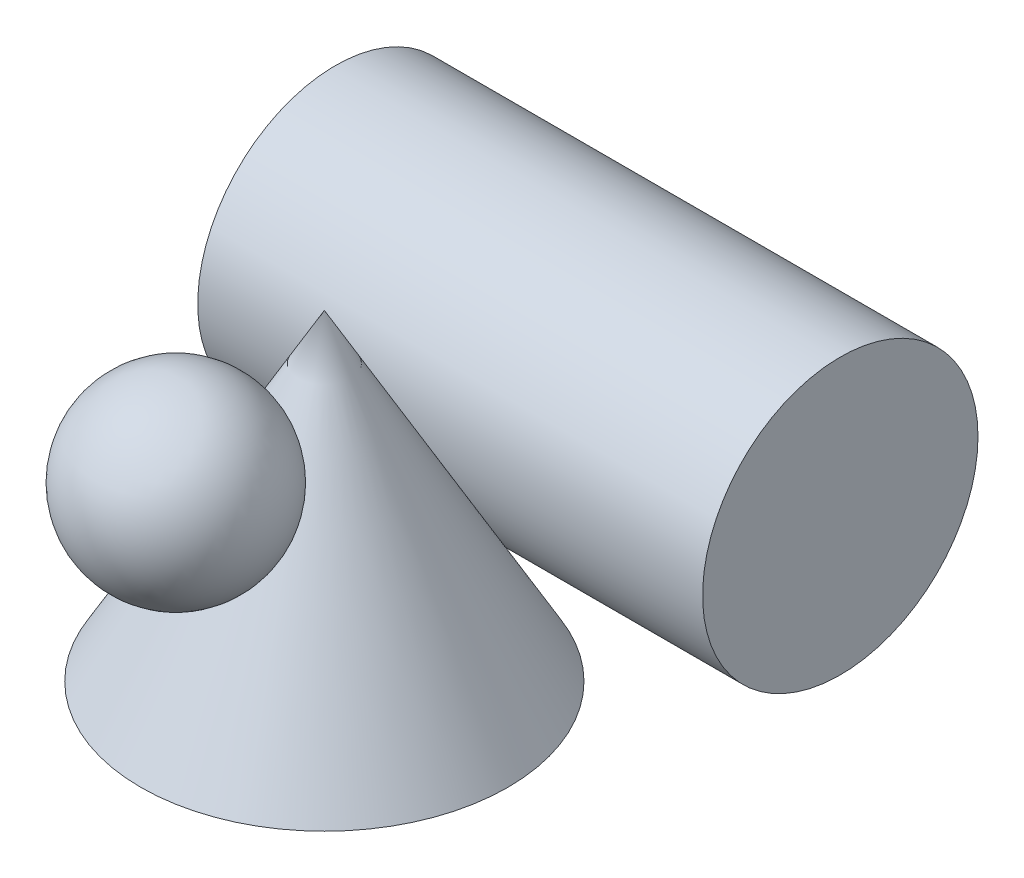
ISO-10303-21;
HEADER;
FILE_DESCRIPTION(('STEP AP214'),'2;1');
FILE_NAME('part.step','',(''),(''),'','','');
FILE_SCHEMA(('AUTOMOTIVE_DESIGN { 1 0 10303 214 1 1 1 1 }'));
ENDSEC;
DATA;
#1=APPLICATION_CONTEXT('core data for automotive mechanical design processes');
#2=APPLICATION_PROTOCOL_DEFINITION('international standard','automotive_design',2000,#1);
#3=PRODUCT_CONTEXT('',#1,'mechanical');
#4=PRODUCT('Part','Part','',(#3));
#5=PRODUCT_RELATED_PRODUCT_CATEGORY('part','',(#4));
#6=PRODUCT_DEFINITION_FORMATION('','',#4);
#7=PRODUCT_DEFINITION_CONTEXT('part definition',#1,'design');
#8=PRODUCT_DEFINITION('design','',#6,#7);
#9=PRODUCT_DEFINITION_SHAPE('','',#8);
#10=(LENGTH_UNIT() NAMED_UNIT(*) SI_UNIT(.MILLI.,.METRE.));
#11=(NAMED_UNIT(*) PLANE_ANGLE_UNIT() SI_UNIT($,.RADIAN.));
#12=(NAMED_UNIT(*) SI_UNIT($,.STERADIAN.) SOLID_ANGLE_UNIT());
#13=UNCERTAINTY_MEASURE_WITH_UNIT(LENGTH_MEASURE(1.E-05),#10,'distance_accuracy_value','');
#14=(GEOMETRIC_REPRESENTATION_CONTEXT(3) GLOBAL_UNCERTAINTY_ASSIGNED_CONTEXT((#13)) GLOBAL_UNIT_ASSIGNED_CONTEXT((#10,
#11,#12)) REPRESENTATION_CONTEXT('',''));
#15=CARTESIAN_POINT('',(0.,0.,0.));
#16=DIRECTION('',(0.,0.,1.));
#17=DIRECTION('',(1.,0.,0.));
#18=AXIS2_PLACEMENT_3D('',#15,#16,#17);
#19=CARTESIAN_POINT('',(0.,53.6727787671367,32.3648628424892));
#20=DIRECTION('',(0.,1.,0.));
#21=DIRECTION('',(0.,0.,-1.));
#22=AXIS2_PLACEMENT_3D('',#19,#20,#21);
#23=SPHERICAL_SURFACE('',#22,20.);
#24=CARTESIAN_POINT('',(0.,73.6727787671367,32.3648628424892));
#25=VERTEX_POINT('',#24);
#26=VERTEX_LOOP('',#25);
#27=FACE_BOUND('',#26,.T.);
#28=ADVANCED_FACE('F36',(#27),#23,.T.);
#29=CLOSED_SHELL('',(#28));
#30=MANIFOLD_SOLID_BREP('B2',#29);
#31=CARTESIAN_POINT('',(-55.,30.,-57.4096760641366));
#32=DIRECTION('',(1.,0.,0.));
#33=DIRECTION('',(0.,0.,-1.));
#34=AXIS2_PLACEMENT_3D('',#31,#32,#33);
#35=CYLINDRICAL_SURFACE('',#34,30.);
#36=CARTESIAN_POINT('',(-55.,30.,-57.4096760641366));
#37=DIRECTION('',(1.,0.,0.));
#38=DIRECTION('',(0.,0.,-1.));
#39=AXIS2_PLACEMENT_3D('',#36,#37,#38);
#40=CIRCLE('',#39,30.);
#41=CARTESIAN_POINT('',(-55.,30.,-87.4096760641366));
#42=VERTEX_POINT('',#41);
#43=EDGE_CURVE('E35',#42,#42,#40,.T.);
#44=ORIENTED_EDGE('',*,*,#43,.T.);
#45=EDGE_LOOP('',(#44));
#46=FACE_BOUND('',#45,.T.);
#47=CARTESIAN_POINT('',(55.,30.,-57.4096760641366));
#48=DIRECTION('',(1.,0.,0.));
#49=DIRECTION('',(0.,0.,-1.));
#50=AXIS2_PLACEMENT_3D('',#47,#48,#49);
#51=CIRCLE('',#50,30.);
#52=CARTESIAN_POINT('',(55.,30.,-87.4096760641366));
#53=VERTEX_POINT('',#52);
#54=EDGE_CURVE('E61',#53,#53,#51,.T.);
#55=ORIENTED_EDGE('',*,*,#54,.F.);
#56=EDGE_LOOP('',(#55));
#57=FACE_BOUND('',#56,.T.);
#58=ADVANCED_FACE('F58',(#46,#57),#35,.T.);
#59=CARTESIAN_POINT('',(-55.,30.,-57.4096760641366));
#60=DIRECTION('',(1.,0.,0.));
#61=DIRECTION('',(0.,0.,-1.));
#62=AXIS2_PLACEMENT_3D('',#59,#60,#61);
#63=PLANE('',#62);
#64=ORIENTED_EDGE('',*,*,#43,.F.);
#65=EDGE_LOOP('',(#64));
#66=FACE_BOUND('',#65,.T.);
#67=ADVANCED_FACE('F73',(#66),#63,.F.);
#68=CARTESIAN_POINT('',(55.,30.,-57.4096760641366));
#69=DIRECTION('',(1.,0.,0.));
#70=DIRECTION('',(0.,0.,-1.));
#71=AXIS2_PLACEMENT_3D('',#68,#69,#70);
#72=PLANE('',#71);
#73=ORIENTED_EDGE('',*,*,#54,.T.);
#74=EDGE_LOOP('',(#73));
#75=FACE_BOUND('',#74,.T.);
#76=ADVANCED_FACE('F70',(#75),#72,.T.);
#77=CLOSED_SHELL('',(#58,#67,#76));
#78=MANIFOLD_SOLID_BREP('B6',#77);
#79=CARTESIAN_POINT('',(0.,0.,0.));
#80=DIRECTION('',(0.,1.,0.));
#81=DIRECTION('',(-1.,0.,0.));
#82=AXIS2_PLACEMENT_3D('',#79,#80,#81);
#83=PLANE('',#82);
#84=CARTESIAN_POINT('',(0.,0.,0.));
#85=DIRECTION('',(0.,1.,0.));
#86=DIRECTION('',(-1.,0.,0.));
#87=AXIS2_PLACEMENT_3D('',#84,#85,#86);
#88=CIRCLE('',#87,40.);
#89=CARTESIAN_POINT('',(-40.,0.,0.));
#90=VERTEX_POINT('',#89);
#91=EDGE_CURVE('E56',#90,#90,#88,.T.);
#92=ORIENTED_EDGE('',*,*,#91,.F.);
#93=EDGE_LOOP('',(#92));
#94=FACE_BOUND('',#93,.T.);
#95=ADVANCED_FACE('F99',(#94),#83,.F.);
#96=CARTESIAN_POINT('',(0.,0.,0.));
#97=DIRECTION('',(0.,-1.,0.));
#98=DIRECTION('',(1.,0.,0.));
#99=AXIS2_PLACEMENT_3D('',#96,#97,#98);
#100=CONICAL_SURFACE('',#99,40.,0.519146114246523);
#101=CARTESIAN_POINT('',(0.,43.75,15.));
#102=VERTEX_POINT('',#101);
#103=VERTEX_LOOP('',#102);
#104=FACE_BOUND('',#103,.T.);
#105=CARTESIAN_POINT('',(0.,15.115831849295,-31.3623818004029));
#106=VERTEX_POINT('',#105);
#107=VERTEX_LOOP('',#106);
#108=FACE_BOUND('',#107,.T.);
#109=CARTESIAN_POINT('',(0.,70.,0.));
#110=VERTEX_POINT('',#109);
#111=VERTEX_LOOP('',#110);
#112=FACE_BOUND('',#111,.T.);
#113=ORIENTED_EDGE('',*,*,#91,.T.);
#114=EDGE_LOOP('',(#113));
#115=FACE_BOUND('',#114,.T.);
#116=ADVANCED_FACE('F114',(#104,#108,#112,#115),#100,.T.);
#117=CLOSED_SHELL('',(#95,#116));
#118=MANIFOLD_SOLID_BREP('B30',#117);
#119=ADVANCED_BREP_SHAPE_REPRESENTATION('',(#18,#30,#78,#118),#14);
#120=SHAPE_DEFINITION_REPRESENTATION(#9,#119);
ENDSEC;
END-ISO-10303-21;
